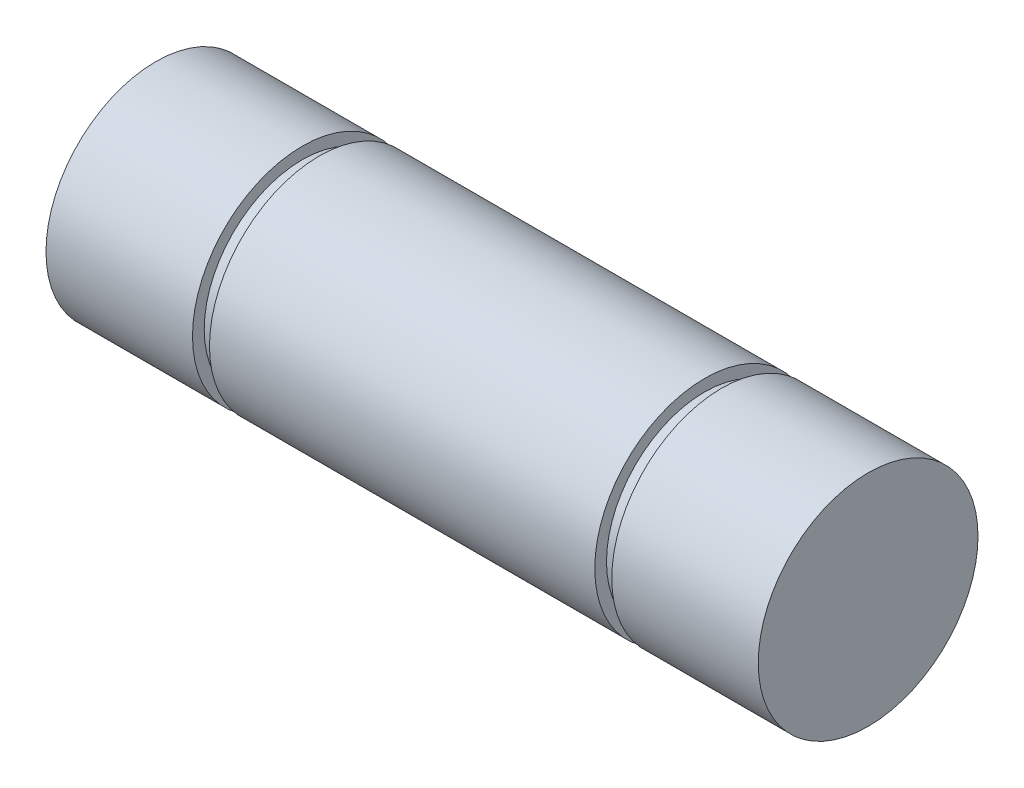
ISO-10303-21;
HEADER;
FILE_DESCRIPTION(('STEP AP214'),'2;1');
FILE_NAME('part.step','',(''),(''),'','','');
FILE_SCHEMA(('AUTOMOTIVE_DESIGN { 1 0 10303 214 1 1 1 1 }'));
ENDSEC;
DATA;
#1=APPLICATION_CONTEXT('core data for automotive mechanical design processes');
#2=APPLICATION_PROTOCOL_DEFINITION('international standard','automotive_design',2000,#1);
#3=PRODUCT_CONTEXT('',#1,'mechanical');
#4=PRODUCT('Part','Part','',(#3));
#5=PRODUCT_RELATED_PRODUCT_CATEGORY('part','',(#4));
#6=PRODUCT_DEFINITION_FORMATION('','',#4);
#7=PRODUCT_DEFINITION_CONTEXT('part definition',#1,'design');
#8=PRODUCT_DEFINITION('design','',#6,#7);
#9=PRODUCT_DEFINITION_SHAPE('','',#8);
#10=(LENGTH_UNIT() NAMED_UNIT(*) SI_UNIT(.MILLI.,.METRE.));
#11=(NAMED_UNIT(*) PLANE_ANGLE_UNIT() SI_UNIT($,.RADIAN.));
#12=(NAMED_UNIT(*) SI_UNIT($,.STERADIAN.) SOLID_ANGLE_UNIT());
#13=UNCERTAINTY_MEASURE_WITH_UNIT(LENGTH_MEASURE(1.E-05),#10,'distance_accuracy_value','');
#14=(GEOMETRIC_REPRESENTATION_CONTEXT(3) GLOBAL_UNCERTAINTY_ASSIGNED_CONTEXT((#13)) GLOBAL_UNIT_ASSIGNED_CONTEXT((#10,
#11,#12)) REPRESENTATION_CONTEXT('',''));
#15=CARTESIAN_POINT('',(0.,0.,0.));
#16=DIRECTION('',(0.,0.,1.));
#17=DIRECTION('',(1.,0.,0.));
#18=AXIS2_PLACEMENT_3D('',#15,#16,#17);
#19=CARTESIAN_POINT('',(470.416352729726,279.172500074,0.));
#20=DIRECTION('',(-1.,0.,0.));
#21=DIRECTION('',(0.,0.,1.));
#22=AXIS2_PLACEMENT_3D('',#19,#20,#21);
#23=PLANE('',#22);
#24=CARTESIAN_POINT('',(470.416352729726,274.410000074,0.));
#25=DIRECTION('',(-1.,0.,0.));
#26=DIRECTION('',(0.,0.,1.));
#27=AXIS2_PLACEMENT_3D('',#24,#25,#26);
#28=CIRCLE('',#27,4.7625);
#29=CARTESIAN_POINT('',(470.416352729726,274.410000074,4.7625));
#30=VERTEX_POINT('',#29);
#31=EDGE_CURVE('E10',#30,#30,#28,.T.);
#32=ORIENTED_EDGE('',*,*,#31,.F.);
#33=EDGE_LOOP('',(#32));
#34=FACE_BOUND('',#33,.T.);
#35=ADVANCED_FACE('F32',(#34),#23,.F.);
#36=CARTESIAN_POINT('',(439.541352729727,274.410000074,0.));
#37=DIRECTION('',(-1.,0.,0.));
#38=DIRECTION('',(0.,0.,1.));
#39=AXIS2_PLACEMENT_3D('',#36,#37,#38);
#40=CYLINDRICAL_SURFACE('',#39,4.7625);
#41=CARTESIAN_POINT('',(464.066352729726,274.410000074,0.));
#42=DIRECTION('',(-1.,0.,0.));
#43=DIRECTION('',(0.,0.,1.));
#44=AXIS2_PLACEMENT_3D('',#41,#42,#43);
#45=CIRCLE('',#44,4.7625);
#46=CARTESIAN_POINT('',(464.066352729726,274.410000074,4.7625));
#47=VERTEX_POINT('',#46);
#48=EDGE_CURVE('E38',#47,#47,#45,.T.);
#49=ORIENTED_EDGE('',*,*,#48,.F.);
#50=EDGE_LOOP('',(#49));
#51=FACE_BOUND('',#50,.T.);
#52=ORIENTED_EDGE('',*,*,#31,.T.);
#53=EDGE_LOOP('',(#52));
#54=FACE_BOUND('',#53,.T.);
#55=ADVANCED_FACE('F116',(#51,#54),#40,.T.);
#56=CARTESIAN_POINT('',(464.066352729726,278.664500074,0.));
#57=DIRECTION('',(1.,0.,0.));
#58=DIRECTION('',(0.,0.,-1.));
#59=AXIS2_PLACEMENT_3D('',#56,#57,#58);
#60=PLANE('',#59);
#61=CARTESIAN_POINT('',(464.066352729726,274.410000074,0.));
#62=DIRECTION('',(-1.,0.,0.));
#63=DIRECTION('',(0.,0.,1.));
#64=AXIS2_PLACEMENT_3D('',#61,#62,#63);
#65=CIRCLE('',#64,4.25449999999999);
#66=CARTESIAN_POINT('',(464.066352729726,274.410000074,4.25449999999999));
#67=VERTEX_POINT('',#66);
#68=EDGE_CURVE('E42',#67,#67,#65,.T.);
#69=ORIENTED_EDGE('',*,*,#68,.F.);
#70=EDGE_LOOP('',(#69));
#71=FACE_BOUND('',#70,.T.);
#72=ORIENTED_EDGE('',*,*,#48,.T.);
#73=EDGE_LOOP('',(#72));
#74=FACE_BOUND('',#73,.T.);
#75=ADVANCED_FACE('F111',(#71,#74),#60,.F.);
#76=CARTESIAN_POINT('',(439.541352729727,274.410000074,0.));
#77=DIRECTION('',(-1.,0.,0.));
#78=DIRECTION('',(0.,0.,1.));
#79=AXIS2_PLACEMENT_3D('',#76,#77,#78);
#80=CYLINDRICAL_SURFACE('',#79,4.25449999999999);
#81=CARTESIAN_POINT('',(463.329752729726,274.410000074,0.));
#82=DIRECTION('',(-1.,0.,0.));
#83=DIRECTION('',(0.,0.,1.));
#84=AXIS2_PLACEMENT_3D('',#81,#82,#83);
#85=CIRCLE('',#84,4.25449999999999);
#86=CARTESIAN_POINT('',(463.329752729726,274.410000074,4.25449999999999));
#87=VERTEX_POINT('',#86);
#88=EDGE_CURVE('E46',#87,#87,#85,.T.);
#89=ORIENTED_EDGE('',*,*,#88,.F.);
#90=EDGE_LOOP('',(#89));
#91=FACE_BOUND('',#90,.T.);
#92=ORIENTED_EDGE('',*,*,#68,.T.);
#93=EDGE_LOOP('',(#92));
#94=FACE_BOUND('',#93,.T.);
#95=ADVANCED_FACE('F105',(#91,#94),#80,.T.);
#96=CARTESIAN_POINT('',(463.329752729726,279.172500074,0.));
#97=DIRECTION('',(-1.,0.,0.));
#98=DIRECTION('',(0.,0.,1.));
#99=AXIS2_PLACEMENT_3D('',#96,#97,#98);
#100=PLANE('',#99);
#101=CARTESIAN_POINT('',(463.329752729726,274.410000074,0.));
#102=DIRECTION('',(-1.,0.,0.));
#103=DIRECTION('',(0.,0.,1.));
#104=AXIS2_PLACEMENT_3D('',#101,#102,#103);
#105=CIRCLE('',#104,4.7625);
#106=CARTESIAN_POINT('',(463.329752729726,274.410000074,4.7625));
#107=VERTEX_POINT('',#106);
#108=EDGE_CURVE('E51',#107,#107,#105,.T.);
#109=ORIENTED_EDGE('',*,*,#108,.F.);
#110=EDGE_LOOP('',(#109));
#111=FACE_BOUND('',#110,.T.);
#112=ORIENTED_EDGE('',*,*,#88,.T.);
#113=EDGE_LOOP('',(#112));
#114=FACE_BOUND('',#113,.T.);
#115=ADVANCED_FACE('F99',(#111,#114),#100,.F.);
#116=CARTESIAN_POINT('',(439.541352729727,274.410000074,0.));
#117=DIRECTION('',(-1.,0.,0.));
#118=DIRECTION('',(0.,0.,1.));
#119=AXIS2_PLACEMENT_3D('',#116,#117,#118);
#120=CYLINDRICAL_SURFACE('',#119,4.7625);
#121=CARTESIAN_POINT('',(446.627952729727,274.410000074,0.));
#122=DIRECTION('',(-1.,0.,0.));
#123=DIRECTION('',(0.,0.,1.));
#124=AXIS2_PLACEMENT_3D('',#121,#122,#123);
#125=CIRCLE('',#124,4.7625);
#126=CARTESIAN_POINT('',(446.627952729727,274.410000074,4.7625));
#127=VERTEX_POINT('',#126);
#128=EDGE_CURVE('E54',#127,#127,#125,.T.);
#129=ORIENTED_EDGE('',*,*,#128,.F.);
#130=EDGE_LOOP('',(#129));
#131=FACE_BOUND('',#130,.T.);
#132=ORIENTED_EDGE('',*,*,#108,.T.);
#133=EDGE_LOOP('',(#132));
#134=FACE_BOUND('',#133,.T.);
#135=ADVANCED_FACE('F93',(#131,#134),#120,.T.);
#136=CARTESIAN_POINT('',(446.627952729727,278.664500074,0.));
#137=DIRECTION('',(1.,0.,0.));
#138=DIRECTION('',(0.,0.,-1.));
#139=AXIS2_PLACEMENT_3D('',#136,#137,#138);
#140=PLANE('',#139);
#141=CARTESIAN_POINT('',(446.627952729727,274.410000074,0.));
#142=DIRECTION('',(-1.,0.,0.));
#143=DIRECTION('',(0.,0.,1.));
#144=AXIS2_PLACEMENT_3D('',#141,#142,#143);
#145=CIRCLE('',#144,4.25449999999999);
#146=CARTESIAN_POINT('',(446.627952729727,274.410000074,4.25449999999999));
#147=VERTEX_POINT('',#146);
#148=EDGE_CURVE('E57',#147,#147,#145,.T.);
#149=ORIENTED_EDGE('',*,*,#148,.F.);
#150=EDGE_LOOP('',(#149));
#151=FACE_BOUND('',#150,.T.);
#152=ORIENTED_EDGE('',*,*,#128,.T.);
#153=EDGE_LOOP('',(#152));
#154=FACE_BOUND('',#153,.T.);
#155=ADVANCED_FACE('F87',(#151,#154),#140,.F.);
#156=CARTESIAN_POINT('',(439.541352729727,274.410000074,0.));
#157=DIRECTION('',(-1.,0.,0.));
#158=DIRECTION('',(0.,0.,1.));
#159=AXIS2_PLACEMENT_3D('',#156,#157,#158);
#160=CYLINDRICAL_SURFACE('',#159,4.25449999999999);
#161=CARTESIAN_POINT('',(445.891352729727,274.410000074,0.));
#162=DIRECTION('',(-1.,0.,0.));
#163=DIRECTION('',(0.,0.,1.));
#164=AXIS2_PLACEMENT_3D('',#161,#162,#163);
#165=CIRCLE('',#164,4.25449999999999);
#166=CARTESIAN_POINT('',(445.891352729727,274.410000074,4.25449999999999));
#167=VERTEX_POINT('',#166);
#168=EDGE_CURVE('E60',#167,#167,#165,.T.);
#169=ORIENTED_EDGE('',*,*,#168,.F.);
#170=EDGE_LOOP('',(#169));
#171=FACE_BOUND('',#170,.T.);
#172=ORIENTED_EDGE('',*,*,#148,.T.);
#173=EDGE_LOOP('',(#172));
#174=FACE_BOUND('',#173,.T.);
#175=ADVANCED_FACE('F81',(#171,#174),#160,.T.);
#176=CARTESIAN_POINT('',(445.891352729727,279.172500074,0.));
#177=DIRECTION('',(-1.,0.,0.));
#178=DIRECTION('',(0.,0.,1.));
#179=AXIS2_PLACEMENT_3D('',#176,#177,#178);
#180=PLANE('',#179);
#181=CARTESIAN_POINT('',(445.891352729727,274.410000074,0.));
#182=DIRECTION('',(-1.,0.,0.));
#183=DIRECTION('',(0.,0.,1.));
#184=AXIS2_PLACEMENT_3D('',#181,#182,#183);
#185=CIRCLE('',#184,4.7625);
#186=CARTESIAN_POINT('',(445.891352729727,274.410000074,4.7625));
#187=VERTEX_POINT('',#186);
#188=EDGE_CURVE('E63',#187,#187,#185,.T.);
#189=ORIENTED_EDGE('',*,*,#188,.F.);
#190=EDGE_LOOP('',(#189));
#191=FACE_BOUND('',#190,.T.);
#192=ORIENTED_EDGE('',*,*,#168,.T.);
#193=EDGE_LOOP('',(#192));
#194=FACE_BOUND('',#193,.T.);
#195=ADVANCED_FACE('F75',(#191,#194),#180,.F.);
#196=CARTESIAN_POINT('',(439.541352729727,274.410000074,0.));
#197=DIRECTION('',(-1.,0.,0.));
#198=DIRECTION('',(0.,0.,1.));
#199=AXIS2_PLACEMENT_3D('',#196,#197,#198);
#200=CYLINDRICAL_SURFACE('',#199,4.7625);
#201=CARTESIAN_POINT('',(439.541352729727,274.410000074,0.));
#202=DIRECTION('',(-1.,0.,0.));
#203=DIRECTION('',(0.,0.,1.));
#204=AXIS2_PLACEMENT_3D('',#201,#202,#203);
#205=CIRCLE('',#204,4.7625);
#206=CARTESIAN_POINT('',(439.541352729727,274.410000074,4.7625));
#207=VERTEX_POINT('',#206);
#208=EDGE_CURVE('E66',#207,#207,#205,.T.);
#209=ORIENTED_EDGE('',*,*,#208,.F.);
#210=EDGE_LOOP('',(#209));
#211=FACE_BOUND('',#210,.T.);
#212=ORIENTED_EDGE('',*,*,#188,.T.);
#213=EDGE_LOOP('',(#212));
#214=FACE_BOUND('',#213,.T.);
#215=ADVANCED_FACE('F72',(#211,#214),#200,.T.);
#216=CARTESIAN_POINT('',(439.541352729727,274.410000074,0.));
#217=DIRECTION('',(1.,0.,0.));
#218=DIRECTION('',(0.,0.,-1.));
#219=AXIS2_PLACEMENT_3D('',#216,#217,#218);
#220=PLANE('',#219);
#221=ORIENTED_EDGE('',*,*,#208,.T.);
#222=EDGE_LOOP('',(#221));
#223=FACE_BOUND('',#222,.T.);
#224=ADVANCED_FACE('F70',(#223),#220,.F.);
#225=CLOSED_SHELL('',(#35,#55,#75,#95,#115,#135,#155,#175,#195,#215,#224));
#226=MANIFOLD_SOLID_BREP('B2',#225);
#227=ADVANCED_BREP_SHAPE_REPRESENTATION('',(#18,#226),#14);
#228=SHAPE_DEFINITION_REPRESENTATION(#9,#227);
ENDSEC;
END-ISO-10303-21;
